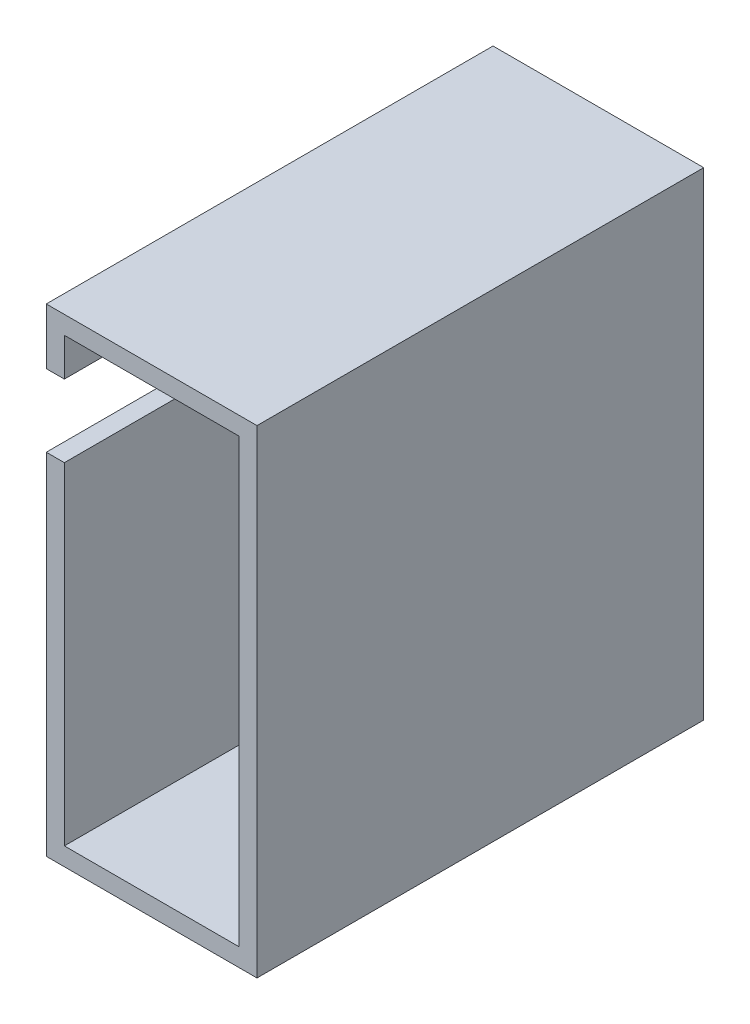
ISO-10303-21;
HEADER;
FILE_DESCRIPTION(('STEP AP214'),'2;1');
FILE_NAME('part.step','',(''),(''),'','','');
FILE_SCHEMA(('AUTOMOTIVE_DESIGN { 1 0 10303 214 1 1 1 1 }'));
ENDSEC;
DATA;
#1=APPLICATION_CONTEXT('core data for automotive mechanical design processes');
#2=APPLICATION_PROTOCOL_DEFINITION('international standard','automotive_design',2000,#1);
#3=PRODUCT_CONTEXT('',#1,'mechanical');
#4=PRODUCT('Part','Part','',(#3));
#5=PRODUCT_RELATED_PRODUCT_CATEGORY('part','',(#4));
#6=PRODUCT_DEFINITION_FORMATION('','',#4);
#7=PRODUCT_DEFINITION_CONTEXT('part definition',#1,'design');
#8=PRODUCT_DEFINITION('design','',#6,#7);
#9=PRODUCT_DEFINITION_SHAPE('','',#8);
#10=(LENGTH_UNIT() NAMED_UNIT(*) SI_UNIT(.MILLI.,.METRE.));
#11=(NAMED_UNIT(*) PLANE_ANGLE_UNIT() SI_UNIT($,.RADIAN.));
#12=(NAMED_UNIT(*) SI_UNIT($,.STERADIAN.) SOLID_ANGLE_UNIT());
#13=UNCERTAINTY_MEASURE_WITH_UNIT(LENGTH_MEASURE(1.E-05),#10,'distance_accuracy_value','');
#14=(GEOMETRIC_REPRESENTATION_CONTEXT(3) GLOBAL_UNCERTAINTY_ASSIGNED_CONTEXT((#13)) GLOBAL_UNIT_ASSIGNED_CONTEXT((#10,
#11,#12)) REPRESENTATION_CONTEXT('',''));
#15=CARTESIAN_POINT('',(0.,0.,0.));
#16=DIRECTION('',(0.,0.,1.));
#17=DIRECTION('',(1.,0.,0.));
#18=AXIS2_PLACEMENT_3D('',#15,#16,#17);
#19=CARTESIAN_POINT('',(0.,0.,47.4));
#20=DIRECTION('',(-1.,0.,0.));
#21=DIRECTION('',(0.,0.,1.));
#22=AXIS2_PLACEMENT_3D('',#19,#20,#21);
#23=PLANE('',#22);
#24=DIRECTION('',(0.,0.,-1.));
#25=VECTOR('',#24,1.);
#26=CARTESIAN_POINT('',(0.,44.7,3.));
#27=LINE('',#26,#25);
#28=CARTESIAN_POINT('',(0.,44.7,47.4));
#29=VERTEX_POINT('',#28);
#30=CARTESIAN_POINT('',(0.,44.7,3.));
#31=VERTEX_POINT('',#30);
#32=EDGE_CURVE('E258',#29,#31,#27,.T.);
#33=ORIENTED_EDGE('',*,*,#32,.T.);
#34=CARTESIAN_POINT('',(0.,40.7,3.));
#35=DIRECTION('',(-1.,0.,0.));
#36=DIRECTION('',(0.,-1.,0.));
#37=AXIS2_PLACEMENT_3D('',#34,#35,#36);
#38=CIRCLE('',#37,4.);
#39=CARTESIAN_POINT('',(0.,43.3457513110646,0.));
#40=VERTEX_POINT('',#39);
#41=EDGE_CURVE('E250',#31,#40,#38,.T.);
#42=ORIENTED_EDGE('',*,*,#41,.T.);
#43=DIRECTION('',(0.,1.,0.));
#44=VECTOR('',#43,1.);
#45=CARTESIAN_POINT('',(0.,0.,0.));
#46=LINE('',#45,#44);
#47=CARTESIAN_POINT('',(0.,48.9,0.));
#48=VERTEX_POINT('',#47);
#49=EDGE_CURVE('E151',#40,#48,#46,.T.);
#50=ORIENTED_EDGE('',*,*,#49,.T.);
#51=DIRECTION('',(0.,0.,-1.));
#52=VECTOR('',#51,1.);
#53=CARTESIAN_POINT('',(0.,48.9,47.4));
#54=LINE('',#53,#52);
#55=CARTESIAN_POINT('',(0.,48.9,47.4));
#56=VERTEX_POINT('',#55);
#57=EDGE_CURVE('E123',#56,#48,#54,.T.);
#58=ORIENTED_EDGE('',*,*,#57,.F.);
#59=DIRECTION('',(0.,1.,0.));
#60=VECTOR('',#59,1.);
#61=CARTESIAN_POINT('',(0.,0.,47.4));
#62=LINE('',#61,#60);
#63=EDGE_CURVE('E134',#29,#56,#62,.T.);
#64=ORIENTED_EDGE('',*,*,#63,.F.);
#65=EDGE_LOOP('',(#33,#42,#50,#58,#64));
#66=FACE_BOUND('',#65,.T.);
#67=ADVANCED_FACE('F44',(#66),#23,.F.);
#68=CARTESIAN_POINT('',(19.3,0.,47.4));
#69=DIRECTION('',(-1.,0.,0.));
#70=DIRECTION('',(0.,0.,1.));
#71=AXIS2_PLACEMENT_3D('',#68,#69,#70);
#72=PLANE('',#71);
#73=DIRECTION('',(0.,1.,0.));
#74=VECTOR('',#73,1.);
#75=CARTESIAN_POINT('',(19.3,0.,0.));
#76=LINE('',#75,#74);
#77=CARTESIAN_POINT('',(19.3,0.,0.));
#78=VERTEX_POINT('',#77);
#79=CARTESIAN_POINT('',(19.3,48.9,0.));
#80=VERTEX_POINT('',#79);
#81=EDGE_CURVE('E146',#78,#80,#76,.T.);
#82=ORIENTED_EDGE('',*,*,#81,.F.);
#83=DIRECTION('',(0.,0.,-1.));
#84=VECTOR('',#83,1.);
#85=CARTESIAN_POINT('',(19.3,0.,47.4));
#86=LINE('',#85,#84);
#87=CARTESIAN_POINT('',(19.3,0.,47.4));
#88=VERTEX_POINT('',#87);
#89=EDGE_CURVE('E11',#88,#78,#86,.T.);
#90=ORIENTED_EDGE('',*,*,#89,.F.);
#91=DIRECTION('',(0.,1.,0.));
#92=VECTOR('',#91,1.);
#93=CARTESIAN_POINT('',(19.3,0.,47.4));
#94=LINE('',#93,#92);
#95=CARTESIAN_POINT('',(19.3,48.9,47.4));
#96=VERTEX_POINT('',#95);
#97=EDGE_CURVE('E138',#88,#96,#94,.T.);
#98=ORIENTED_EDGE('',*,*,#97,.T.);
#99=DIRECTION('',(0.,0.,-1.));
#100=VECTOR('',#99,1.);
#101=CARTESIAN_POINT('',(19.3,48.9,47.4));
#102=LINE('',#101,#100);
#103=EDGE_CURVE('E87',#96,#80,#102,.T.);
#104=ORIENTED_EDGE('',*,*,#103,.T.);
#105=EDGE_LOOP('',(#82,#90,#98,#104));
#106=FACE_BOUND('',#105,.T.);
#107=ADVANCED_FACE('F238',(#106),#72,.T.);
#108=CARTESIAN_POINT('',(0.,0.,47.4));
#109=DIRECTION('',(0.,1.,0.));
#110=DIRECTION('',(0.,0.,1.));
#111=AXIS2_PLACEMENT_3D('',#108,#109,#110);
#112=PLANE('',#111);
#113=DIRECTION('',(1.,0.,0.));
#114=VECTOR('',#113,1.);
#115=CARTESIAN_POINT('',(0.,0.,0.));
#116=LINE('',#115,#114);
#117=CARTESIAN_POINT('',(0.,0.,0.));
#118=VERTEX_POINT('',#117);
#119=EDGE_CURVE('E119',#118,#78,#116,.T.);
#120=ORIENTED_EDGE('',*,*,#119,.F.);
#121=DIRECTION('',(0.,0.,-1.));
#122=VECTOR('',#121,1.);
#123=CARTESIAN_POINT('',(0.,0.,47.4));
#124=LINE('',#123,#122);
#125=CARTESIAN_POINT('',(0.,0.,47.4));
#126=VERTEX_POINT('',#125);
#127=EDGE_CURVE('E53',#126,#118,#124,.T.);
#128=ORIENTED_EDGE('',*,*,#127,.F.);
#129=DIRECTION('',(1.,0.,0.));
#130=VECTOR('',#129,1.);
#131=CARTESIAN_POINT('',(0.,0.,47.4));
#132=LINE('',#131,#130);
#133=EDGE_CURVE('E117',#126,#88,#132,.T.);
#134=ORIENTED_EDGE('',*,*,#133,.T.);
#135=ORIENTED_EDGE('',*,*,#89,.T.);
#136=EDGE_LOOP('',(#120,#128,#134,#135));
#137=FACE_BOUND('',#136,.T.);
#138=ADVANCED_FACE('F115',(#137),#112,.T.);
#139=CARTESIAN_POINT('',(0.,38.0542486889354,0.));
#140=VERTEX_POINT('',#139);
#141=EDGE_CURVE('E152',#118,#140,#46,.T.);
#142=ORIENTED_EDGE('',*,*,#141,.T.);
#143=CARTESIAN_POINT('',(0.,36.7,3.));
#144=VERTEX_POINT('',#143);
#145=EDGE_CURVE('E244',#140,#144,#38,.T.);
#146=ORIENTED_EDGE('',*,*,#145,.T.);
#147=DIRECTION('',(0.,0.,1.));
#148=VECTOR('',#147,1.);
#149=CARTESIAN_POINT('',(0.,36.7,3.));
#150=LINE('',#149,#148);
#151=CARTESIAN_POINT('',(0.,36.7,47.4));
#152=VERTEX_POINT('',#151);
#153=EDGE_CURVE('E132',#144,#152,#150,.T.);
#154=ORIENTED_EDGE('',*,*,#153,.T.);
#155=EDGE_CURVE('E127',#126,#152,#62,.T.);
#156=ORIENTED_EDGE('',*,*,#155,.F.);
#157=ORIENTED_EDGE('',*,*,#127,.T.);
#158=EDGE_LOOP('',(#142,#146,#154,#156,#157));
#159=FACE_BOUND('',#158,.T.);
#160=ADVANCED_FACE('F128',(#159),#23,.F.);
#161=CARTESIAN_POINT('',(21.3,0.,47.4));
#162=DIRECTION('',(1.,0.,0.));
#163=DIRECTION('',(0.,1.,0.));
#164=AXIS2_PLACEMENT_3D('',#161,#162,#163);
#165=PLANE('',#164);
#166=DIRECTION('',(0.,0.,-1.));
#167=VECTOR('',#166,1.);
#168=CARTESIAN_POINT('',(21.3,-2.,47.4));
#169=LINE('',#168,#167);
#170=CARTESIAN_POINT('',(21.3,-2.,47.4));
#171=VERTEX_POINT('',#170);
#172=CARTESIAN_POINT('',(21.3,-2.,-2.));
#173=VERTEX_POINT('',#172);
#174=EDGE_CURVE('E145',#171,#173,#169,.T.);
#175=ORIENTED_EDGE('',*,*,#174,.T.);
#176=DIRECTION('',(0.,-1.,0.));
#177=VECTOR('',#176,1.);
#178=CARTESIAN_POINT('',(21.3,50.9,-2.));
#179=LINE('',#178,#177);
#180=CARTESIAN_POINT('',(21.3,50.9,-2.));
#181=VERTEX_POINT('',#180);
#182=EDGE_CURVE('E185',#181,#173,#179,.T.);
#183=ORIENTED_EDGE('',*,*,#182,.F.);
#184=DIRECTION('',(0.,0.,-1.));
#185=VECTOR('',#184,1.);
#186=CARTESIAN_POINT('',(21.3,50.9,47.4));
#187=LINE('',#186,#185);
#188=CARTESIAN_POINT('',(21.3,50.9,47.4));
#189=VERTEX_POINT('',#188);
#190=EDGE_CURVE('E48',#189,#181,#187,.T.);
#191=ORIENTED_EDGE('',*,*,#190,.F.);
#192=DIRECTION('',(0.,-1.,0.));
#193=VECTOR('',#192,1.);
#194=CARTESIAN_POINT('',(21.3,0.,47.4));
#195=LINE('',#194,#193);
#196=EDGE_CURVE('E157',#189,#171,#195,.T.);
#197=ORIENTED_EDGE('',*,*,#196,.T.);
#198=EDGE_LOOP('',(#175,#183,#191,#197));
#199=FACE_BOUND('',#198,.T.);
#200=ADVANCED_FACE('F46',(#199),#165,.T.);
#201=CARTESIAN_POINT('',(0.,50.9,47.4));
#202=DIRECTION('',(0.,1.,0.));
#203=DIRECTION('',(0.,0.,1.));
#204=AXIS2_PLACEMENT_3D('',#201,#202,#203);
#205=PLANE('',#204);
#206=ORIENTED_EDGE('',*,*,#190,.T.);
#207=DIRECTION('',(1.,0.,0.));
#208=VECTOR('',#207,1.);
#209=CARTESIAN_POINT('',(-2.,50.9,-2.));
#210=LINE('',#209,#208);
#211=CARTESIAN_POINT('',(-2.,50.9,-2.));
#212=VERTEX_POINT('',#211);
#213=EDGE_CURVE('E178',#212,#181,#210,.T.);
#214=ORIENTED_EDGE('',*,*,#213,.F.);
#215=DIRECTION('',(0.,0.,-1.));
#216=VECTOR('',#215,1.);
#217=CARTESIAN_POINT('',(-2.,50.9,47.4));
#218=LINE('',#217,#216);
#219=CARTESIAN_POINT('',(-2.,50.9,47.4));
#220=VERTEX_POINT('',#219);
#221=EDGE_CURVE('E165',#220,#212,#218,.T.);
#222=ORIENTED_EDGE('',*,*,#221,.F.);
#223=DIRECTION('',(1.,0.,0.));
#224=VECTOR('',#223,1.);
#225=CARTESIAN_POINT('',(0.,50.9,47.4));
#226=LINE('',#225,#224);
#227=EDGE_CURVE('E180',#220,#189,#226,.T.);
#228=ORIENTED_EDGE('',*,*,#227,.T.);
#229=EDGE_LOOP('',(#206,#214,#222,#228));
#230=FACE_BOUND('',#229,.T.);
#231=ADVANCED_FACE('F176',(#230),#205,.T.);
#232=CARTESIAN_POINT('',(-1.99999999999999,0.,47.4));
#233=DIRECTION('',(1.,0.,0.));
#234=DIRECTION('',(0.,1.,0.));
#235=AXIS2_PLACEMENT_3D('',#232,#233,#234);
#236=PLANE('',#235);
#237=CARTESIAN_POINT('',(-2.,40.7,3.));
#238=DIRECTION('',(-1.,0.,0.));
#239=DIRECTION('',(0.,-1.,0.));
#240=AXIS2_PLACEMENT_3D('',#237,#238,#239);
#241=CIRCLE('',#240,4.);
#242=CARTESIAN_POINT('',(-2.,44.7,3.));
#243=VERTEX_POINT('',#242);
#244=CARTESIAN_POINT('',(-2.,36.7,3.));
#245=VERTEX_POINT('',#244);
#246=EDGE_CURVE('E261',#243,#245,#241,.T.);
#247=ORIENTED_EDGE('',*,*,#246,.F.);
#248=DIRECTION('',(0.,0.,-1.));
#249=VECTOR('',#248,1.);
#250=CARTESIAN_POINT('',(-2.,44.7,3.));
#251=LINE('',#250,#249);
#252=CARTESIAN_POINT('',(-2.,44.7,47.4));
#253=VERTEX_POINT('',#252);
#254=EDGE_CURVE('E248',#253,#243,#251,.T.);
#255=ORIENTED_EDGE('',*,*,#254,.F.);
#256=DIRECTION('',(0.,-1.,0.));
#257=VECTOR('',#256,1.);
#258=CARTESIAN_POINT('',(-1.99999999999999,0.,47.4));
#259=LINE('',#258,#257);
#260=EDGE_CURVE('E207',#220,#253,#259,.T.);
#261=ORIENTED_EDGE('',*,*,#260,.F.);
#262=ORIENTED_EDGE('',*,*,#221,.T.);
#263=DIRECTION('',(0.,1.,0.));
#264=VECTOR('',#263,1.);
#265=CARTESIAN_POINT('',(-1.99999999999999,-2.,-2.));
#266=LINE('',#265,#264);
#267=CARTESIAN_POINT('',(-1.99999999999999,-2.,-2.));
#268=VERTEX_POINT('',#267);
#269=EDGE_CURVE('E149',#268,#212,#266,.T.);
#270=ORIENTED_EDGE('',*,*,#269,.F.);
#271=DIRECTION('',(0.,0.,-1.));
#272=VECTOR('',#271,1.);
#273=CARTESIAN_POINT('',(-1.99999999999999,-2.,47.4));
#274=LINE('',#273,#272);
#275=CARTESIAN_POINT('',(-1.99999999999999,-2.,47.4));
#276=VERTEX_POINT('',#275);
#277=EDGE_CURVE('E163',#276,#268,#274,.T.);
#278=ORIENTED_EDGE('',*,*,#277,.F.);
#279=CARTESIAN_POINT('',(-2.,36.7,47.4));
#280=VERTEX_POINT('',#279);
#281=EDGE_CURVE('E206',#280,#276,#259,.T.);
#282=ORIENTED_EDGE('',*,*,#281,.F.);
#283=DIRECTION('',(0.,0.,1.));
#284=VECTOR('',#283,1.);
#285=CARTESIAN_POINT('',(-2.,36.7,3.));
#286=LINE('',#285,#284);
#287=EDGE_CURVE('E223',#245,#280,#286,.T.);
#288=ORIENTED_EDGE('',*,*,#287,.F.);
#289=EDGE_LOOP('',(#247,#255,#261,#262,#270,#278,#282,#288));
#290=FACE_BOUND('',#289,.T.);
#291=ADVANCED_FACE('F218',(#290),#236,.F.);
#292=CARTESIAN_POINT('',(0.,-2.,47.4));
#293=DIRECTION('',(0.,1.,0.));
#294=DIRECTION('',(0.,0.,1.));
#295=AXIS2_PLACEMENT_3D('',#292,#293,#294);
#296=PLANE('',#295);
#297=ORIENTED_EDGE('',*,*,#277,.T.);
#298=DIRECTION('',(-1.,0.,0.));
#299=VECTOR('',#298,1.);
#300=CARTESIAN_POINT('',(21.3,-2.,-2.));
#301=LINE('',#300,#299);
#302=EDGE_CURVE('E190',#173,#268,#301,.T.);
#303=ORIENTED_EDGE('',*,*,#302,.F.);
#304=ORIENTED_EDGE('',*,*,#174,.F.);
#305=DIRECTION('',(1.,0.,0.));
#306=VECTOR('',#305,1.);
#307=CARTESIAN_POINT('',(0.,-2.,47.4));
#308=LINE('',#307,#306);
#309=EDGE_CURVE('E140',#276,#171,#308,.T.);
#310=ORIENTED_EDGE('',*,*,#309,.F.);
#311=EDGE_LOOP('',(#297,#303,#304,#310));
#312=FACE_BOUND('',#311,.T.);
#313=ADVANCED_FACE('F213',(#312),#296,.F.);
#314=CARTESIAN_POINT('',(0.,48.9,47.4));
#315=DIRECTION('',(0.,1.,0.));
#316=DIRECTION('',(0.,0.,1.));
#317=AXIS2_PLACEMENT_3D('',#314,#315,#316);
#318=PLANE('',#317);
#319=DIRECTION('',(1.,0.,0.));
#320=VECTOR('',#319,1.);
#321=CARTESIAN_POINT('',(0.,48.9,0.));
#322=LINE('',#321,#320);
#323=EDGE_CURVE('E154',#48,#80,#322,.T.);
#324=ORIENTED_EDGE('',*,*,#323,.T.);
#325=ORIENTED_EDGE('',*,*,#103,.F.);
#326=DIRECTION('',(1.,0.,0.));
#327=VECTOR('',#326,1.);
#328=CARTESIAN_POINT('',(0.,48.9,47.4));
#329=LINE('',#328,#327);
#330=EDGE_CURVE('E69',#56,#96,#329,.T.);
#331=ORIENTED_EDGE('',*,*,#330,.F.);
#332=ORIENTED_EDGE('',*,*,#57,.T.);
#333=EDGE_LOOP('',(#324,#325,#331,#332));
#334=FACE_BOUND('',#333,.T.);
#335=ADVANCED_FACE('F277',(#334),#318,.F.);
#336=CARTESIAN_POINT('',(0.,0.,47.4));
#337=DIRECTION('',(0.,0.,1.));
#338=DIRECTION('',(1.,0.,0.));
#339=AXIS2_PLACEMENT_3D('',#336,#337,#338);
#340=PLANE('',#339);
#341=DIRECTION('',(-1.,0.,0.));
#342=VECTOR('',#341,1.);
#343=CARTESIAN_POINT('',(0.,44.7,47.4));
#344=LINE('',#343,#342);
#345=EDGE_CURVE('E196',#29,#253,#344,.T.);
#346=ORIENTED_EDGE('',*,*,#345,.F.);
#347=ORIENTED_EDGE('',*,*,#63,.T.);
#348=ORIENTED_EDGE('',*,*,#330,.T.);
#349=ORIENTED_EDGE('',*,*,#97,.F.);
#350=ORIENTED_EDGE('',*,*,#133,.F.);
#351=ORIENTED_EDGE('',*,*,#155,.T.);
#352=DIRECTION('',(-1.,0.,0.));
#353=VECTOR('',#352,1.);
#354=CARTESIAN_POINT('',(0.,36.7,47.4));
#355=LINE('',#354,#353);
#356=EDGE_CURVE('E265',#152,#280,#355,.T.);
#357=ORIENTED_EDGE('',*,*,#356,.T.);
#358=ORIENTED_EDGE('',*,*,#281,.T.);
#359=ORIENTED_EDGE('',*,*,#309,.T.);
#360=ORIENTED_EDGE('',*,*,#196,.F.);
#361=ORIENTED_EDGE('',*,*,#227,.F.);
#362=ORIENTED_EDGE('',*,*,#260,.T.);
#363=EDGE_LOOP('',(#346,#347,#348,#349,#350,#351,#357,#358,#359,#360,#361,#362));
#364=FACE_BOUND('',#363,.T.);
#365=ADVANCED_FACE('F137',(#364),#340,.T.);
#366=CARTESIAN_POINT('',(0.,0.,0.));
#367=DIRECTION('',(0.,0.,-1.));
#368=DIRECTION('',(-1.,0.,0.));
#369=AXIS2_PLACEMENT_3D('',#366,#367,#368);
#370=PLANE('',#369);
#371=ORIENTED_EDGE('',*,*,#119,.T.);
#372=ORIENTED_EDGE('',*,*,#81,.T.);
#373=ORIENTED_EDGE('',*,*,#323,.F.);
#374=ORIENTED_EDGE('',*,*,#49,.F.);
#375=EDGE_CURVE('E155',#140,#40,#46,.T.);
#376=ORIENTED_EDGE('',*,*,#375,.F.);
#377=ORIENTED_EDGE('',*,*,#141,.F.);
#378=EDGE_LOOP('',(#371,#372,#373,#374,#376,#377));
#379=FACE_BOUND('',#378,.T.);
#380=ADVANCED_FACE('F241',(#379),#370,.F.);
#381=CARTESIAN_POINT('',(0.,0.,-2.));
#382=DIRECTION('',(0.,0.,-1.));
#383=DIRECTION('',(-1.,0.,0.));
#384=AXIS2_PLACEMENT_3D('',#381,#382,#383);
#385=PLANE('',#384);
#386=ORIENTED_EDGE('',*,*,#213,.T.);
#387=ORIENTED_EDGE('',*,*,#182,.T.);
#388=ORIENTED_EDGE('',*,*,#302,.T.);
#389=ORIENTED_EDGE('',*,*,#269,.T.);
#390=EDGE_LOOP('',(#386,#387,#388,#389));
#391=FACE_BOUND('',#390,.T.);
#392=ADVANCED_FACE('F192',(#391),#385,.T.);
#393=CARTESIAN_POINT('',(0.,40.7,3.));
#394=DIRECTION('',(-1.,0.,0.));
#395=DIRECTION('',(0.,-1.,0.));
#396=AXIS2_PLACEMENT_3D('',#393,#394,#395);
#397=PLANE('',#396);
#398=ORIENTED_EDGE('',*,*,#375,.T.);
#399=EDGE_CURVE('E60',#40,#140,#38,.T.);
#400=ORIENTED_EDGE('',*,*,#399,.T.);
#401=EDGE_LOOP('',(#398,#400));
#402=FACE_BOUND('',#401,.T.);
#403=ADVANCED_FACE('F278',(#402),#397,.T.);
#404=CARTESIAN_POINT('',(0.,40.7,3.));
#405=DIRECTION('',(-1.,0.,0.));
#406=DIRECTION('',(0.,-1.,0.));
#407=AXIS2_PLACEMENT_3D('',#404,#405,#406);
#408=CYLINDRICAL_SURFACE('',#407,4.);
#409=ORIENTED_EDGE('',*,*,#246,.T.);
#410=DIRECTION('',(-1.,0.,0.));
#411=VECTOR('',#410,1.);
#412=CARTESIAN_POINT('',(0.,36.7,3.));
#413=LINE('',#412,#411);
#414=EDGE_CURVE('E199',#144,#245,#413,.T.);
#415=ORIENTED_EDGE('',*,*,#414,.F.);
#416=ORIENTED_EDGE('',*,*,#145,.F.);
#417=ORIENTED_EDGE('',*,*,#399,.F.);
#418=ORIENTED_EDGE('',*,*,#41,.F.);
#419=DIRECTION('',(-1.,0.,0.));
#420=VECTOR('',#419,1.);
#421=CARTESIAN_POINT('',(0.,44.7,3.));
#422=LINE('',#421,#420);
#423=EDGE_CURVE('E193',#31,#243,#422,.T.);
#424=ORIENTED_EDGE('',*,*,#423,.T.);
#425=EDGE_LOOP('',(#409,#415,#416,#417,#418,#424));
#426=FACE_BOUND('',#425,.T.);
#427=ADVANCED_FACE('F267',(#426),#408,.F.);
#428=CARTESIAN_POINT('',(0.,44.7,3.));
#429=DIRECTION('',(0.,1.,0.));
#430=DIRECTION('',(-1.,0.,0.));
#431=AXIS2_PLACEMENT_3D('',#428,#429,#430);
#432=PLANE('',#431);
#433=ORIENTED_EDGE('',*,*,#254,.T.);
#434=ORIENTED_EDGE('',*,*,#423,.F.);
#435=ORIENTED_EDGE('',*,*,#32,.F.);
#436=ORIENTED_EDGE('',*,*,#345,.T.);
#437=EDGE_LOOP('',(#433,#434,#435,#436));
#438=FACE_BOUND('',#437,.T.);
#439=ADVANCED_FACE('F280',(#438),#432,.F.);
#440=CARTESIAN_POINT('',(0.,36.7,3.));
#441=DIRECTION('',(0.,-1.,0.));
#442=DIRECTION('',(1.,0.,0.));
#443=AXIS2_PLACEMENT_3D('',#440,#441,#442);
#444=PLANE('',#443);
#445=ORIENTED_EDGE('',*,*,#287,.T.);
#446=ORIENTED_EDGE('',*,*,#356,.F.);
#447=ORIENTED_EDGE('',*,*,#153,.F.);
#448=ORIENTED_EDGE('',*,*,#414,.T.);
#449=EDGE_LOOP('',(#445,#446,#447,#448));
#450=FACE_BOUND('',#449,.T.);
#451=ADVANCED_FACE('F266',(#450),#444,.F.);
#452=CLOSED_SHELL('',(#67,#107,#138,#160,#200,#231,#291,#313,#335,#365,#380,#392,#403,#427,#439,#451));
#453=MANIFOLD_SOLID_BREP('B2',#452);
#454=ADVANCED_BREP_SHAPE_REPRESENTATION('',(#18,#453),#14);
#455=SHAPE_DEFINITION_REPRESENTATION(#9,#454);
ENDSEC;
END-ISO-10303-21;
